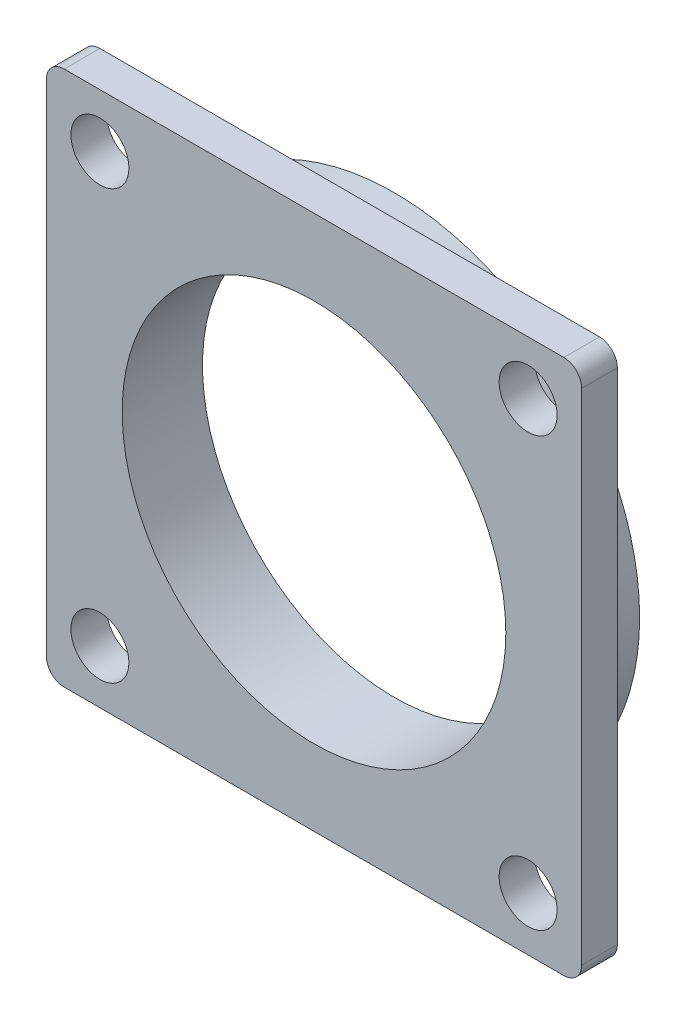
ISO-10303-21;
HEADER;
FILE_DESCRIPTION(('STEP AP214'),'2;1');
FILE_NAME('part.step','',(''),(''),'','','');
FILE_SCHEMA(('AUTOMOTIVE_DESIGN { 1 0 10303 214 1 1 1 1 }'));
ENDSEC;
DATA;
#1=APPLICATION_CONTEXT('core data for automotive mechanical design processes');
#2=APPLICATION_PROTOCOL_DEFINITION('international standard','automotive_design',2000,#1);
#3=PRODUCT_CONTEXT('',#1,'mechanical');
#4=PRODUCT('Part','Part','',(#3));
#5=PRODUCT_RELATED_PRODUCT_CATEGORY('part','',(#4));
#6=PRODUCT_DEFINITION_FORMATION('','',#4);
#7=PRODUCT_DEFINITION_CONTEXT('part definition',#1,'design');
#8=PRODUCT_DEFINITION('design','',#6,#7);
#9=PRODUCT_DEFINITION_SHAPE('','',#8);
#10=(LENGTH_UNIT() NAMED_UNIT(*) SI_UNIT(.MILLI.,.METRE.));
#11=(NAMED_UNIT(*) PLANE_ANGLE_UNIT() SI_UNIT($,.RADIAN.));
#12=(NAMED_UNIT(*) SI_UNIT($,.STERADIAN.) SOLID_ANGLE_UNIT());
#13=UNCERTAINTY_MEASURE_WITH_UNIT(LENGTH_MEASURE(1.E-05),#10,'distance_accuracy_value','');
#14=(GEOMETRIC_REPRESENTATION_CONTEXT(3) GLOBAL_UNCERTAINTY_ASSIGNED_CONTEXT((#13)) GLOBAL_UNIT_ASSIGNED_CONTEXT((#10,
#11,#12)) REPRESENTATION_CONTEXT('',''));
#15=CARTESIAN_POINT('',(0.,0.,0.));
#16=DIRECTION('',(0.,0.,1.));
#17=DIRECTION('',(1.,0.,0.));
#18=AXIS2_PLACEMENT_3D('',#15,#16,#17);
#19=CARTESIAN_POINT('',(24.9945631591184,-11.6314365532019,0.));
#20=DIRECTION('',(0.,0.,1.));
#21=DIRECTION('',(1.,0.,0.));
#22=AXIS2_PLACEMENT_3D('',#19,#20,#21);
#23=PLANE('',#22);
#24=CARTESIAN_POINT('',(24.9945631591184,-11.6314365532019,0.));
#25=DIRECTION('',(0.,0.,1.));
#26=DIRECTION('',(1.,0.,0.));
#27=AXIS2_PLACEMENT_3D('',#24,#25,#26);
#28=CIRCLE('',#27,13.75);
#29=CARTESIAN_POINT('',(38.7445631591183,-11.6314365532019,0.));
#30=VERTEX_POINT('',#29);
#31=EDGE_CURVE('E140',#30,#30,#28,.T.);
#32=ORIENTED_EDGE('',*,*,#31,.F.);
#33=EDGE_LOOP('',(#32));
#34=FACE_BOUND('',#33,.T.);
#35=CARTESIAN_POINT('',(24.9945631591184,-11.6314365532019,0.));
#36=DIRECTION('',(0.,0.,1.));
#37=DIRECTION('',(1.,0.,0.));
#38=AXIS2_PLACEMENT_3D('',#35,#36,#37);
#39=CIRCLE('',#38,10.75);
#40=CARTESIAN_POINT('',(35.7445631591183,-11.6314365532019,0.));
#41=VERTEX_POINT('',#40);
#42=EDGE_CURVE('E137',#41,#41,#39,.T.);
#43=ORIENTED_EDGE('',*,*,#42,.T.);
#44=EDGE_LOOP('',(#43));
#45=FACE_BOUND('',#44,.T.);
#46=ADVANCED_FACE('F33',(#34,#45),#23,.F.);
#47=CARTESIAN_POINT('',(24.9945631591184,-11.6314365532019,2.5));
#48=DIRECTION('',(0.,0.,-1.));
#49=DIRECTION('',(-1.,0.,0.));
#50=AXIS2_PLACEMENT_3D('',#47,#48,#49);
#51=CYLINDRICAL_SURFACE('',#50,13.75);
#52=CARTESIAN_POINT('',(24.9945631591184,-11.6314365532019,2.5));
#53=DIRECTION('',(0.,0.,1.));
#54=DIRECTION('',(1.,0.,0.));
#55=AXIS2_PLACEMENT_3D('',#52,#53,#54);
#56=CIRCLE('',#55,13.75);
#57=CARTESIAN_POINT('',(38.7445631591183,-11.6314365532019,2.5));
#58=VERTEX_POINT('',#57);
#59=EDGE_CURVE('E142',#58,#58,#56,.T.);
#60=ORIENTED_EDGE('',*,*,#59,.F.);
#61=EDGE_LOOP('',(#60));
#62=FACE_BOUND('',#61,.T.);
#63=ORIENTED_EDGE('',*,*,#31,.T.);
#64=EDGE_LOOP('',(#63));
#65=FACE_BOUND('',#64,.T.);
#66=ADVANCED_FACE('F238',(#62,#65),#51,.T.);
#67=CARTESIAN_POINT('',(24.9945631591184,-11.6314365532019,2.5));
#68=DIRECTION('',(0.,0.,-1.));
#69=DIRECTION('',(-1.,0.,0.));
#70=AXIS2_PLACEMENT_3D('',#67,#68,#69);
#71=CYLINDRICAL_SURFACE('',#70,10.75);
#72=ORIENTED_EDGE('',*,*,#42,.F.);
#73=EDGE_LOOP('',(#72));
#74=FACE_BOUND('',#73,.T.);
#75=CARTESIAN_POINT('',(24.9945631591184,-11.6314365532019,4.5));
#76=DIRECTION('',(0.,0.,1.));
#77=DIRECTION('',(1.,0.,0.));
#78=AXIS2_PLACEMENT_3D('',#75,#76,#77);
#79=CIRCLE('',#78,10.75);
#80=CARTESIAN_POINT('',(35.7445631591183,-11.6314365532019,4.5));
#81=VERTEX_POINT('',#80);
#82=EDGE_CURVE('E147',#81,#81,#79,.T.);
#83=ORIENTED_EDGE('',*,*,#82,.T.);
#84=EDGE_LOOP('',(#83));
#85=FACE_BOUND('',#84,.T.);
#86=ADVANCED_FACE('F193',(#74,#85),#71,.F.);
#87=CARTESIAN_POINT('',(0.,0.,4.5));
#88=DIRECTION('',(0.,0.,1.));
#89=DIRECTION('',(1.,0.,0.));
#90=AXIS2_PLACEMENT_3D('',#87,#88,#89);
#91=PLANE('',#90);
#92=ORIENTED_EDGE('',*,*,#82,.F.);
#93=EDGE_LOOP('',(#92));
#94=FACE_BOUND('',#93,.T.);
#95=CARTESIAN_POINT('',(12.9945631591184,-23.6314365532019,4.5));
#96=DIRECTION('',(0.,0.,1.));
#97=DIRECTION('',(1.,0.,0.));
#98=AXIS2_PLACEMENT_3D('',#95,#96,#97);
#99=CIRCLE('',#98,1.625);
#100=CARTESIAN_POINT('',(14.6195631591184,-23.6314365532019,4.5));
#101=VERTEX_POINT('',#100);
#102=EDGE_CURVE('E207',#101,#101,#99,.T.);
#103=ORIENTED_EDGE('',*,*,#102,.F.);
#104=EDGE_LOOP('',(#103));
#105=FACE_BOUND('',#104,.T.);
#106=CARTESIAN_POINT('',(12.9945631591184,0.368563446798118,4.5));
#107=DIRECTION('',(0.,0.,1.));
#108=DIRECTION('',(1.,0.,0.));
#109=AXIS2_PLACEMENT_3D('',#106,#107,#108);
#110=CIRCLE('',#109,1.625);
#111=CARTESIAN_POINT('',(14.6195631591183,0.368563446798118,4.5));
#112=VERTEX_POINT('',#111);
#113=EDGE_CURVE('E131',#112,#112,#110,.T.);
#114=ORIENTED_EDGE('',*,*,#113,.F.);
#115=EDGE_LOOP('',(#114));
#116=FACE_BOUND('',#115,.T.);
#117=DIRECTION('',(0.,-1.,0.));
#118=VECTOR('',#117,1.);
#119=CARTESIAN_POINT('',(9.99456315911836,3.36856344679812,4.5));
#120=LINE('',#119,#118);
#121=CARTESIAN_POINT('',(9.99456315911836,2.36856344679812,4.5));
#122=VERTEX_POINT('',#121);
#123=CARTESIAN_POINT('',(9.99456315911836,-25.6314365532019,4.5));
#124=VERTEX_POINT('',#123);
#125=EDGE_CURVE('E136',#122,#124,#120,.T.);
#126=ORIENTED_EDGE('',*,*,#125,.T.);
#127=CARTESIAN_POINT('',(10.9945631591184,-25.6314365532019,4.5));
#128=DIRECTION('',(0.,0.,1.));
#129=DIRECTION('',(1.,0.,0.));
#130=AXIS2_PLACEMENT_3D('',#127,#128,#129);
#131=CIRCLE('',#130,1.);
#132=CARTESIAN_POINT('',(10.9945631591184,-26.6314365532019,4.5));
#133=VERTEX_POINT('',#132);
#134=EDGE_CURVE('E164',#124,#133,#131,.T.);
#135=ORIENTED_EDGE('',*,*,#134,.T.);
#136=DIRECTION('',(1.,0.,0.));
#137=VECTOR('',#136,1.);
#138=CARTESIAN_POINT('',(9.99456315911836,-26.6314365532019,4.5));
#139=LINE('',#138,#137);
#140=CARTESIAN_POINT('',(38.9945631591183,-26.6314365532019,4.5));
#141=VERTEX_POINT('',#140);
#142=EDGE_CURVE('E118',#133,#141,#139,.T.);
#143=ORIENTED_EDGE('',*,*,#142,.T.);
#144=CARTESIAN_POINT('',(38.9945631591183,-25.6314365532019,4.5));
#145=DIRECTION('',(0.,0.,1.));
#146=DIRECTION('',(1.,0.,0.));
#147=AXIS2_PLACEMENT_3D('',#144,#145,#146);
#148=CIRCLE('',#147,1.);
#149=CARTESIAN_POINT('',(39.9945631591184,-25.6314365532019,4.5));
#150=VERTEX_POINT('',#149);
#151=EDGE_CURVE('E162',#141,#150,#148,.T.);
#152=ORIENTED_EDGE('',*,*,#151,.T.);
#153=DIRECTION('',(0.,1.,0.));
#154=VECTOR('',#153,1.);
#155=CARTESIAN_POINT('',(39.9945631591184,3.36856344679812,4.5));
#156=LINE('',#155,#154);
#157=CARTESIAN_POINT('',(39.9945631591184,2.36856344679812,4.5));
#158=VERTEX_POINT('',#157);
#159=EDGE_CURVE('E184',#150,#158,#156,.T.);
#160=ORIENTED_EDGE('',*,*,#159,.T.);
#161=CARTESIAN_POINT('',(38.9945631591183,2.36856344679812,4.5));
#162=DIRECTION('',(0.,0.,1.));
#163=DIRECTION('',(1.,0.,0.));
#164=AXIS2_PLACEMENT_3D('',#161,#162,#163);
#165=CIRCLE('',#164,1.);
#166=CARTESIAN_POINT('',(38.9945631591183,3.36856344679812,4.5));
#167=VERTEX_POINT('',#166);
#168=EDGE_CURVE('E53',#158,#167,#165,.T.);
#169=ORIENTED_EDGE('',*,*,#168,.T.);
#170=DIRECTION('',(-1.,0.,0.));
#171=VECTOR('',#170,1.);
#172=CARTESIAN_POINT('',(9.99456315911836,3.36856344679812,4.5));
#173=LINE('',#172,#171);
#174=CARTESIAN_POINT('',(10.9945631591184,3.36856344679812,4.5));
#175=VERTEX_POINT('',#174);
#176=EDGE_CURVE('E141',#167,#175,#173,.T.);
#177=ORIENTED_EDGE('',*,*,#176,.T.);
#178=CARTESIAN_POINT('',(10.9945631591184,2.36856344679812,4.5));
#179=DIRECTION('',(0.,0.,1.));
#180=DIRECTION('',(1.,0.,0.));
#181=AXIS2_PLACEMENT_3D('',#178,#179,#180);
#182=CIRCLE('',#181,1.);
#183=EDGE_CURVE('E160',#175,#122,#182,.T.);
#184=ORIENTED_EDGE('',*,*,#183,.T.);
#185=EDGE_LOOP('',(#126,#135,#143,#152,#160,#169,#177,#184));
#186=FACE_BOUND('',#185,.T.);
#187=CARTESIAN_POINT('',(36.9945631591183,0.368563446798118,4.5));
#188=DIRECTION('',(0.,0.,1.));
#189=DIRECTION('',(1.,0.,0.));
#190=AXIS2_PLACEMENT_3D('',#187,#188,#189);
#191=CIRCLE('',#190,1.625);
#192=CARTESIAN_POINT('',(38.6195631591183,0.368563446798118,4.5));
#193=VERTEX_POINT('',#192);
#194=EDGE_CURVE('E199',#193,#193,#191,.T.);
#195=ORIENTED_EDGE('',*,*,#194,.F.);
#196=EDGE_LOOP('',(#195));
#197=FACE_BOUND('',#196,.T.);
#198=CARTESIAN_POINT('',(36.9945631591183,-23.6314365532019,4.5));
#199=DIRECTION('',(0.,0.,1.));
#200=DIRECTION('',(1.,0.,0.));
#201=AXIS2_PLACEMENT_3D('',#198,#199,#200);
#202=CIRCLE('',#201,1.625);
#203=CARTESIAN_POINT('',(38.6195631591183,-23.6314365532019,4.5));
#204=VERTEX_POINT('',#203);
#205=EDGE_CURVE('E202',#204,#204,#202,.T.);
#206=ORIENTED_EDGE('',*,*,#205,.F.);
#207=EDGE_LOOP('',(#206));
#208=FACE_BOUND('',#207,.T.);
#209=ADVANCED_FACE('F190',(#94,#105,#116,#186,#197,#208),#91,.T.);
#210=CARTESIAN_POINT('',(0.,0.,2.5));
#211=DIRECTION('',(0.,0.,1.));
#212=DIRECTION('',(1.,0.,0.));
#213=AXIS2_PLACEMENT_3D('',#210,#211,#212);
#214=PLANE('',#213);
#215=ORIENTED_EDGE('',*,*,#59,.T.);
#216=EDGE_LOOP('',(#215));
#217=FACE_BOUND('',#216,.T.);
#218=DIRECTION('',(1.,0.,0.));
#219=VECTOR('',#218,1.);
#220=CARTESIAN_POINT('',(9.99456315911836,-26.6314365532019,2.5));
#221=LINE('',#220,#219);
#222=CARTESIAN_POINT('',(10.9945631591184,-26.6314365532019,2.5));
#223=VERTEX_POINT('',#222);
#224=CARTESIAN_POINT('',(38.9945631591183,-26.6314365532019,2.5));
#225=VERTEX_POINT('',#224);
#226=EDGE_CURVE('E115',#223,#225,#221,.T.);
#227=ORIENTED_EDGE('',*,*,#226,.F.);
#228=CARTESIAN_POINT('',(10.9945631591184,-25.6314365532019,2.5));
#229=DIRECTION('',(0.,0.,1.));
#230=DIRECTION('',(1.,0.,0.));
#231=AXIS2_PLACEMENT_3D('',#228,#229,#230);
#232=CIRCLE('',#231,1.);
#233=CARTESIAN_POINT('',(9.99456315911836,-25.6314365532019,2.5));
#234=VERTEX_POINT('',#233);
#235=EDGE_CURVE('E98',#223,#234,#232,.F.);
#236=ORIENTED_EDGE('',*,*,#235,.T.);
#237=DIRECTION('',(0.,-1.,0.));
#238=VECTOR('',#237,1.);
#239=CARTESIAN_POINT('',(9.99456315911836,3.36856344679812,2.5));
#240=LINE('',#239,#238);
#241=CARTESIAN_POINT('',(9.99456315911836,2.36856344679812,2.5));
#242=VERTEX_POINT('',#241);
#243=EDGE_CURVE('E126',#242,#234,#240,.T.);
#244=ORIENTED_EDGE('',*,*,#243,.F.);
#245=CARTESIAN_POINT('',(10.9945631591184,2.36856344679812,2.5));
#246=DIRECTION('',(0.,0.,1.));
#247=DIRECTION('',(1.,0.,0.));
#248=AXIS2_PLACEMENT_3D('',#245,#246,#247);
#249=CIRCLE('',#248,1.);
#250=CARTESIAN_POINT('',(10.9945631591184,3.36856344679812,2.5));
#251=VERTEX_POINT('',#250);
#252=EDGE_CURVE('E153',#242,#251,#249,.F.);
#253=ORIENTED_EDGE('',*,*,#252,.T.);
#254=DIRECTION('',(-1.,0.,0.));
#255=VECTOR('',#254,1.);
#256=CARTESIAN_POINT('',(9.99456315911836,3.36856344679812,2.5));
#257=LINE('',#256,#255);
#258=CARTESIAN_POINT('',(38.9945631591183,3.36856344679812,2.5));
#259=VERTEX_POINT('',#258);
#260=EDGE_CURVE('E129',#259,#251,#257,.T.);
#261=ORIENTED_EDGE('',*,*,#260,.F.);
#262=CARTESIAN_POINT('',(38.9945631591183,2.36856344679812,2.5));
#263=DIRECTION('',(0.,0.,1.));
#264=DIRECTION('',(1.,0.,0.));
#265=AXIS2_PLACEMENT_3D('',#262,#263,#264);
#266=CIRCLE('',#265,1.);
#267=CARTESIAN_POINT('',(39.9945631591184,2.36856344679812,2.5));
#268=VERTEX_POINT('',#267);
#269=EDGE_CURVE('E119',#259,#268,#266,.F.);
#270=ORIENTED_EDGE('',*,*,#269,.T.);
#271=DIRECTION('',(0.,1.,0.));
#272=VECTOR('',#271,1.);
#273=CARTESIAN_POINT('',(39.9945631591184,3.36856344679812,2.5));
#274=LINE('',#273,#272);
#275=CARTESIAN_POINT('',(39.9945631591184,-25.6314365532019,2.5));
#276=VERTEX_POINT('',#275);
#277=EDGE_CURVE('E125',#276,#268,#274,.T.);
#278=ORIENTED_EDGE('',*,*,#277,.F.);
#279=CARTESIAN_POINT('',(38.9945631591183,-25.6314365532019,2.5));
#280=DIRECTION('',(0.,0.,1.));
#281=DIRECTION('',(1.,0.,0.));
#282=AXIS2_PLACEMENT_3D('',#279,#280,#281);
#283=CIRCLE('',#282,1.);
#284=EDGE_CURVE('E109',#276,#225,#283,.F.);
#285=ORIENTED_EDGE('',*,*,#284,.T.);
#286=EDGE_LOOP('',(#227,#236,#244,#253,#261,#270,#278,#285));
#287=FACE_BOUND('',#286,.T.);
#288=CARTESIAN_POINT('',(12.9945631591184,0.368563446798118,2.5));
#289=DIRECTION('',(0.,0.,1.));
#290=DIRECTION('',(1.,0.,0.));
#291=AXIS2_PLACEMENT_3D('',#288,#289,#290);
#292=CIRCLE('',#291,1.625);
#293=CARTESIAN_POINT('',(14.6195631591183,0.368563446798118,2.5));
#294=VERTEX_POINT('',#293);
#295=EDGE_CURVE('E187',#294,#294,#292,.T.);
#296=ORIENTED_EDGE('',*,*,#295,.T.);
#297=EDGE_LOOP('',(#296));
#298=FACE_BOUND('',#297,.T.);
#299=CARTESIAN_POINT('',(36.9945631591183,0.368563446798118,2.5));
#300=DIRECTION('',(0.,0.,1.));
#301=DIRECTION('',(1.,0.,0.));
#302=AXIS2_PLACEMENT_3D('',#299,#300,#301);
#303=CIRCLE('',#302,1.625);
#304=CARTESIAN_POINT('',(38.6195631591183,0.368563446798118,2.5));
#305=VERTEX_POINT('',#304);
#306=EDGE_CURVE('E213',#305,#305,#303,.T.);
#307=ORIENTED_EDGE('',*,*,#306,.T.);
#308=EDGE_LOOP('',(#307));
#309=FACE_BOUND('',#308,.T.);
#310=CARTESIAN_POINT('',(12.9945631591184,-23.6314365532019,2.5));
#311=DIRECTION('',(0.,0.,1.));
#312=DIRECTION('',(1.,0.,0.));
#313=AXIS2_PLACEMENT_3D('',#310,#311,#312);
#314=CIRCLE('',#313,1.625);
#315=CARTESIAN_POINT('',(14.6195631591184,-23.6314365532019,2.5));
#316=VERTEX_POINT('',#315);
#317=EDGE_CURVE('E204',#316,#316,#314,.T.);
#318=ORIENTED_EDGE('',*,*,#317,.T.);
#319=EDGE_LOOP('',(#318));
#320=FACE_BOUND('',#319,.T.);
#321=CARTESIAN_POINT('',(36.9945631591183,-23.6314365532019,2.5));
#322=DIRECTION('',(0.,0.,1.));
#323=DIRECTION('',(1.,0.,0.));
#324=AXIS2_PLACEMENT_3D('',#321,#322,#323);
#325=CIRCLE('',#324,1.625);
#326=CARTESIAN_POINT('',(38.6195631591183,-23.6314365532019,2.5));
#327=VERTEX_POINT('',#326);
#328=EDGE_CURVE('E150',#327,#327,#325,.T.);
#329=ORIENTED_EDGE('',*,*,#328,.T.);
#330=EDGE_LOOP('',(#329));
#331=FACE_BOUND('',#330,.T.);
#332=ADVANCED_FACE('F122',(#217,#287,#298,#309,#320,#331),#214,.F.);
#333=CARTESIAN_POINT('',(9.99456315911836,3.36856344679812,4.5));
#334=DIRECTION('',(1.,0.,0.));
#335=DIRECTION('',(0.,1.,0.));
#336=AXIS2_PLACEMENT_3D('',#333,#334,#335);
#337=PLANE('',#336);
#338=ORIENTED_EDGE('',*,*,#243,.T.);
#339=DIRECTION('',(0.,0.,-1.));
#340=VECTOR('',#339,1.);
#341=CARTESIAN_POINT('',(9.99456315911836,-25.6314365532019,4.5));
#342=LINE('',#341,#340);
#343=EDGE_CURVE('E103',#234,#124,#342,.F.);
#344=ORIENTED_EDGE('',*,*,#343,.T.);
#345=ORIENTED_EDGE('',*,*,#125,.F.);
#346=DIRECTION('',(0.,0.,-1.));
#347=VECTOR('',#346,1.);
#348=CARTESIAN_POINT('',(9.99456315911836,2.36856344679812,4.5));
#349=LINE('',#348,#347);
#350=EDGE_CURVE('E108',#122,#242,#349,.T.);
#351=ORIENTED_EDGE('',*,*,#350,.T.);
#352=EDGE_LOOP('',(#338,#344,#345,#351));
#353=FACE_BOUND('',#352,.T.);
#354=ADVANCED_FACE('F181',(#353),#337,.F.);
#355=CARTESIAN_POINT('',(9.99456315911836,-26.6314365532019,4.5));
#356=DIRECTION('',(0.,1.,0.));
#357=DIRECTION('',(0.,0.,1.));
#358=AXIS2_PLACEMENT_3D('',#355,#356,#357);
#359=PLANE('',#358);
#360=ORIENTED_EDGE('',*,*,#142,.F.);
#361=DIRECTION('',(0.,0.,-1.));
#362=VECTOR('',#361,1.);
#363=CARTESIAN_POINT('',(10.9945631591184,-26.6314365532019,4.5));
#364=LINE('',#363,#362);
#365=EDGE_CURVE('E102',#133,#223,#364,.T.);
#366=ORIENTED_EDGE('',*,*,#365,.T.);
#367=ORIENTED_EDGE('',*,*,#226,.T.);
#368=DIRECTION('',(0.,0.,-1.));
#369=VECTOR('',#368,1.);
#370=CARTESIAN_POINT('',(38.9945631591183,-26.6314365532019,4.5));
#371=LINE('',#370,#369);
#372=EDGE_CURVE('E120',#225,#141,#371,.F.);
#373=ORIENTED_EDGE('',*,*,#372,.T.);
#374=EDGE_LOOP('',(#360,#366,#367,#373));
#375=FACE_BOUND('',#374,.T.);
#376=ADVANCED_FACE('F114',(#375),#359,.F.);
#377=CARTESIAN_POINT('',(39.9945631591184,3.36856344679812,4.5));
#378=DIRECTION('',(-1.,0.,0.));
#379=DIRECTION('',(0.,0.,1.));
#380=AXIS2_PLACEMENT_3D('',#377,#378,#379);
#381=PLANE('',#380);
#382=ORIENTED_EDGE('',*,*,#159,.F.);
#383=DIRECTION('',(0.,0.,-1.));
#384=VECTOR('',#383,1.);
#385=CARTESIAN_POINT('',(39.9945631591184,-25.6314365532019,4.5));
#386=LINE('',#385,#384);
#387=EDGE_CURVE('E168',#150,#276,#386,.T.);
#388=ORIENTED_EDGE('',*,*,#387,.T.);
#389=ORIENTED_EDGE('',*,*,#277,.T.);
#390=DIRECTION('',(0.,0.,-1.));
#391=VECTOR('',#390,1.);
#392=CARTESIAN_POINT('',(39.9945631591184,2.36856344679812,4.5));
#393=LINE('',#392,#391);
#394=EDGE_CURVE('E166',#268,#158,#393,.F.);
#395=ORIENTED_EDGE('',*,*,#394,.T.);
#396=EDGE_LOOP('',(#382,#388,#389,#395));
#397=FACE_BOUND('',#396,.T.);
#398=ADVANCED_FACE('F235',(#397),#381,.F.);
#399=CARTESIAN_POINT('',(9.99456315911836,3.36856344679812,4.5));
#400=DIRECTION('',(0.,-1.,0.));
#401=DIRECTION('',(0.,0.,-1.));
#402=AXIS2_PLACEMENT_3D('',#399,#400,#401);
#403=PLANE('',#402);
#404=ORIENTED_EDGE('',*,*,#260,.T.);
#405=DIRECTION('',(0.,0.,-1.));
#406=VECTOR('',#405,1.);
#407=CARTESIAN_POINT('',(10.9945631591184,3.36856344679812,4.5));
#408=LINE('',#407,#406);
#409=EDGE_CURVE('E11',#251,#175,#408,.F.);
#410=ORIENTED_EDGE('',*,*,#409,.T.);
#411=ORIENTED_EDGE('',*,*,#176,.F.);
#412=DIRECTION('',(0.,0.,-1.));
#413=VECTOR('',#412,1.);
#414=CARTESIAN_POINT('',(38.9945631591183,3.36856344679812,4.5));
#415=LINE('',#414,#413);
#416=EDGE_CURVE('E41',#167,#259,#415,.T.);
#417=ORIENTED_EDGE('',*,*,#416,.T.);
#418=EDGE_LOOP('',(#404,#410,#411,#417));
#419=FACE_BOUND('',#418,.T.);
#420=ADVANCED_FACE('F173',(#419),#403,.F.);
#421=CARTESIAN_POINT('',(12.9945631591184,0.368563446798118,4.5));
#422=DIRECTION('',(0.,0.,-1.));
#423=DIRECTION('',(-1.,0.,0.));
#424=AXIS2_PLACEMENT_3D('',#421,#422,#423);
#425=CYLINDRICAL_SURFACE('',#424,1.625);
#426=ORIENTED_EDGE('',*,*,#113,.T.);
#427=EDGE_LOOP('',(#426));
#428=FACE_BOUND('',#427,.T.);
#429=ORIENTED_EDGE('',*,*,#295,.F.);
#430=EDGE_LOOP('',(#429));
#431=FACE_BOUND('',#430,.T.);
#432=ADVANCED_FACE('F224',(#428,#431),#425,.F.);
#433=CARTESIAN_POINT('',(36.9945631591183,0.368563446798118,4.5));
#434=DIRECTION('',(0.,0.,-1.));
#435=DIRECTION('',(-1.,0.,0.));
#436=AXIS2_PLACEMENT_3D('',#433,#434,#435);
#437=CYLINDRICAL_SURFACE('',#436,1.625);
#438=ORIENTED_EDGE('',*,*,#194,.T.);
#439=EDGE_LOOP('',(#438));
#440=FACE_BOUND('',#439,.T.);
#441=ORIENTED_EDGE('',*,*,#306,.F.);
#442=EDGE_LOOP('',(#441));
#443=FACE_BOUND('',#442,.T.);
#444=ADVANCED_FACE('F226',(#440,#443),#437,.F.);
#445=CARTESIAN_POINT('',(12.9945631591184,-23.6314365532019,4.5));
#446=DIRECTION('',(0.,0.,-1.));
#447=DIRECTION('',(-1.,0.,0.));
#448=AXIS2_PLACEMENT_3D('',#445,#446,#447);
#449=CYLINDRICAL_SURFACE('',#448,1.625);
#450=ORIENTED_EDGE('',*,*,#102,.T.);
#451=EDGE_LOOP('',(#450));
#452=FACE_BOUND('',#451,.T.);
#453=ORIENTED_EDGE('',*,*,#317,.F.);
#454=EDGE_LOOP('',(#453));
#455=FACE_BOUND('',#454,.T.);
#456=ADVANCED_FACE('F232',(#452,#455),#449,.F.);
#457=CARTESIAN_POINT('',(36.9945631591183,-23.6314365532019,4.5));
#458=DIRECTION('',(0.,0.,-1.));
#459=DIRECTION('',(-1.,0.,0.));
#460=AXIS2_PLACEMENT_3D('',#457,#458,#459);
#461=CYLINDRICAL_SURFACE('',#460,1.625);
#462=ORIENTED_EDGE('',*,*,#205,.T.);
#463=EDGE_LOOP('',(#462));
#464=FACE_BOUND('',#463,.T.);
#465=ORIENTED_EDGE('',*,*,#328,.F.);
#466=EDGE_LOOP('',(#465));
#467=FACE_BOUND('',#466,.T.);
#468=ADVANCED_FACE('F254',(#464,#467),#461,.F.);
#469=CARTESIAN_POINT('',(10.9945631591184,-25.6314365532019,4.5));
#470=DIRECTION('',(0.,0.,-1.));
#471=DIRECTION('',(-1.,0.,0.));
#472=AXIS2_PLACEMENT_3D('',#469,#470,#471);
#473=CYLINDRICAL_SURFACE('',#472,1.);
#474=ORIENTED_EDGE('',*,*,#134,.F.);
#475=ORIENTED_EDGE('',*,*,#343,.F.);
#476=ORIENTED_EDGE('',*,*,#235,.F.);
#477=ORIENTED_EDGE('',*,*,#365,.F.);
#478=EDGE_LOOP('',(#474,#475,#476,#477));
#479=FACE_BOUND('',#478,.T.);
#480=ADVANCED_FACE('F101',(#479),#473,.T.);
#481=CARTESIAN_POINT('',(38.9945631591183,-25.6314365532019,4.5));
#482=DIRECTION('',(0.,0.,-1.));
#483=DIRECTION('',(-1.,0.,0.));
#484=AXIS2_PLACEMENT_3D('',#481,#482,#483);
#485=CYLINDRICAL_SURFACE('',#484,1.);
#486=ORIENTED_EDGE('',*,*,#151,.F.);
#487=ORIENTED_EDGE('',*,*,#372,.F.);
#488=ORIENTED_EDGE('',*,*,#284,.F.);
#489=ORIENTED_EDGE('',*,*,#387,.F.);
#490=EDGE_LOOP('',(#486,#487,#488,#489));
#491=FACE_BOUND('',#490,.T.);
#492=ADVANCED_FACE('F253',(#491),#485,.T.);
#493=CARTESIAN_POINT('',(10.9945631591184,2.36856344679812,4.5));
#494=DIRECTION('',(0.,0.,-1.));
#495=DIRECTION('',(-1.,0.,0.));
#496=AXIS2_PLACEMENT_3D('',#493,#494,#495);
#497=CYLINDRICAL_SURFACE('',#496,1.);
#498=ORIENTED_EDGE('',*,*,#183,.F.);
#499=ORIENTED_EDGE('',*,*,#409,.F.);
#500=ORIENTED_EDGE('',*,*,#252,.F.);
#501=ORIENTED_EDGE('',*,*,#350,.F.);
#502=EDGE_LOOP('',(#498,#499,#500,#501));
#503=FACE_BOUND('',#502,.T.);
#504=ADVANCED_FACE('F178',(#503),#497,.T.);
#505=CARTESIAN_POINT('',(38.9945631591183,2.36856344679812,4.5));
#506=DIRECTION('',(0.,0.,-1.));
#507=DIRECTION('',(-1.,0.,0.));
#508=AXIS2_PLACEMENT_3D('',#505,#506,#507);
#509=CYLINDRICAL_SURFACE('',#508,1.);
#510=ORIENTED_EDGE('',*,*,#168,.F.);
#511=ORIENTED_EDGE('',*,*,#394,.F.);
#512=ORIENTED_EDGE('',*,*,#269,.F.);
#513=ORIENTED_EDGE('',*,*,#416,.F.);
#514=EDGE_LOOP('',(#510,#511,#512,#513));
#515=FACE_BOUND('',#514,.T.);
#516=ADVANCED_FACE('F35',(#515),#509,.T.);
#517=CLOSED_SHELL('',(#46,#66,#86,#209,#332,#354,#376,#398,#420,#432,#444,#456,#468,#480,#492,
#504,#516));
#518=MANIFOLD_SOLID_BREP('B2',#517);
#519=ADVANCED_BREP_SHAPE_REPRESENTATION('',(#18,#518),#14);
#520=SHAPE_DEFINITION_REPRESENTATION(#9,#519);
ENDSEC;
END-ISO-10303-21;
